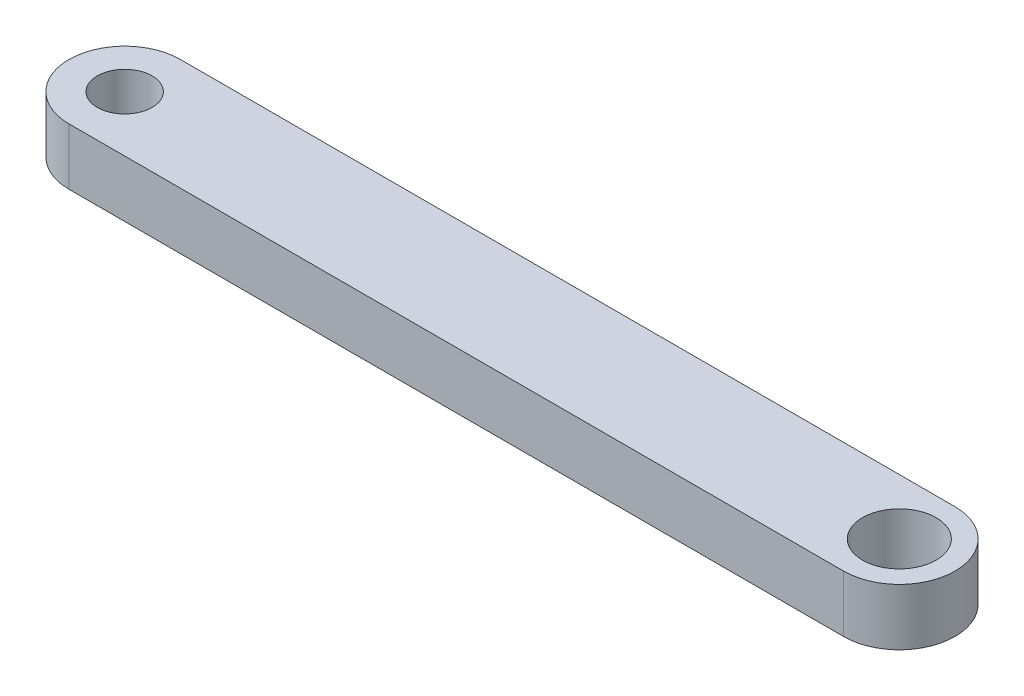
ISO-10303-21;
HEADER;
FILE_DESCRIPTION(('STEP AP214'),'2;1');
FILE_NAME('part.step','',(''),(''),'','','');
FILE_SCHEMA(('AUTOMOTIVE_DESIGN { 1 0 10303 214 1 1 1 1 }'));
ENDSEC;
DATA;
#1=APPLICATION_CONTEXT('core data for automotive mechanical design processes');
#2=APPLICATION_PROTOCOL_DEFINITION('international standard','automotive_design',2000,#1);
#3=PRODUCT_CONTEXT('',#1,'mechanical');
#4=PRODUCT('Part','Part','',(#3));
#5=PRODUCT_RELATED_PRODUCT_CATEGORY('part','',(#4));
#6=PRODUCT_DEFINITION_FORMATION('','',#4);
#7=PRODUCT_DEFINITION_CONTEXT('part definition',#1,'design');
#8=PRODUCT_DEFINITION('design','',#6,#7);
#9=PRODUCT_DEFINITION_SHAPE('','',#8);
#10=(LENGTH_UNIT() NAMED_UNIT(*) SI_UNIT(.MILLI.,.METRE.));
#11=(NAMED_UNIT(*) PLANE_ANGLE_UNIT() SI_UNIT($,.RADIAN.));
#12=(NAMED_UNIT(*) SI_UNIT($,.STERADIAN.) SOLID_ANGLE_UNIT());
#13=UNCERTAINTY_MEASURE_WITH_UNIT(LENGTH_MEASURE(1.E-05),#10,'distance_accuracy_value','');
#14=(GEOMETRIC_REPRESENTATION_CONTEXT(3) GLOBAL_UNCERTAINTY_ASSIGNED_CONTEXT((#13)) GLOBAL_UNIT_ASSIGNED_CONTEXT((#10,
#11,#12)) REPRESENTATION_CONTEXT('',''));
#15=CARTESIAN_POINT('',(0.,0.,0.));
#16=DIRECTION('',(0.,0.,1.));
#17=DIRECTION('',(1.,0.,0.));
#18=AXIS2_PLACEMENT_3D('',#15,#16,#17);
#19=CARTESIAN_POINT('',(32.,3.,0.));
#20=DIRECTION('',(0.,-1.,0.));
#21=DIRECTION('',(0.,0.,-1.));
#22=AXIS2_PLACEMENT_3D('',#19,#20,#21);
#23=CYLINDRICAL_SURFACE('',#22,2.95);
#24=CARTESIAN_POINT('',(32.,0.,0.));
#25=DIRECTION('',(0.,-1.,0.));
#26=DIRECTION('',(0.,0.,-1.));
#27=AXIS2_PLACEMENT_3D('',#24,#25,#26);
#28=CIRCLE('',#27,2.95);
#29=CARTESIAN_POINT('',(32.,0.,-2.95));
#30=VERTEX_POINT('',#29);
#31=CARTESIAN_POINT('',(32.,0.,2.95));
#32=VERTEX_POINT('',#31);
#33=EDGE_CURVE('E98',#30,#32,#28,.T.);
#34=ORIENTED_EDGE('',*,*,#33,.F.);
#35=DIRECTION('',(0.,-1.,0.));
#36=VECTOR('',#35,1.);
#37=CARTESIAN_POINT('',(32.,3.,-2.95));
#38=LINE('',#37,#36);
#39=CARTESIAN_POINT('',(32.,3.,-2.95));
#40=VERTEX_POINT('',#39);
#41=EDGE_CURVE('E11',#40,#30,#38,.T.);
#42=ORIENTED_EDGE('',*,*,#41,.F.);
#43=CARTESIAN_POINT('',(32.,3.,0.));
#44=DIRECTION('',(0.,-1.,0.));
#45=DIRECTION('',(0.,0.,-1.));
#46=AXIS2_PLACEMENT_3D('',#43,#44,#45);
#47=CIRCLE('',#46,2.95);
#48=CARTESIAN_POINT('',(32.,3.,2.95));
#49=VERTEX_POINT('',#48);
#50=EDGE_CURVE('E91',#40,#49,#47,.T.);
#51=ORIENTED_EDGE('',*,*,#50,.T.);
#52=DIRECTION('',(0.,-1.,0.));
#53=VECTOR('',#52,1.);
#54=CARTESIAN_POINT('',(32.,3.,2.95));
#55=LINE('',#54,#53);
#56=EDGE_CURVE('E36',#49,#32,#55,.T.);
#57=ORIENTED_EDGE('',*,*,#56,.T.);
#58=EDGE_LOOP('',(#34,#42,#51,#57));
#59=FACE_BOUND('',#58,.T.);
#60=ADVANCED_FACE('F33',(#59),#23,.T.);
#61=CARTESIAN_POINT('',(-9.,3.,-2.95));
#62=DIRECTION('',(0.,0.,-1.));
#63=DIRECTION('',(-1.,0.,0.));
#64=AXIS2_PLACEMENT_3D('',#61,#62,#63);
#65=PLANE('',#64);
#66=DIRECTION('',(1.,0.,0.));
#67=VECTOR('',#66,1.);
#68=CARTESIAN_POINT('',(-9.,0.,-2.95));
#69=LINE('',#68,#67);
#70=CARTESIAN_POINT('',(-9.,0.,-2.95));
#71=VERTEX_POINT('',#70);
#72=EDGE_CURVE('E93',#71,#30,#69,.T.);
#73=ORIENTED_EDGE('',*,*,#72,.F.);
#74=DIRECTION('',(0.,-1.,0.));
#75=VECTOR('',#74,1.);
#76=CARTESIAN_POINT('',(-9.,3.,-2.95));
#77=LINE('',#76,#75);
#78=CARTESIAN_POINT('',(-9.,3.,-2.95));
#79=VERTEX_POINT('',#78);
#80=EDGE_CURVE('E42',#79,#71,#77,.T.);
#81=ORIENTED_EDGE('',*,*,#80,.F.);
#82=DIRECTION('',(1.,0.,0.));
#83=VECTOR('',#82,1.);
#84=CARTESIAN_POINT('',(-9.,3.,-2.95));
#85=LINE('',#84,#83);
#86=EDGE_CURVE('E88',#79,#40,#85,.T.);
#87=ORIENTED_EDGE('',*,*,#86,.T.);
#88=ORIENTED_EDGE('',*,*,#41,.T.);
#89=EDGE_LOOP('',(#73,#81,#87,#88));
#90=FACE_BOUND('',#89,.T.);
#91=ADVANCED_FACE('F109',(#90),#65,.T.);
#92=CARTESIAN_POINT('',(-9.,3.,0.));
#93=DIRECTION('',(0.,-1.,0.));
#94=DIRECTION('',(0.,0.,-1.));
#95=AXIS2_PLACEMENT_3D('',#92,#93,#94);
#96=CYLINDRICAL_SURFACE('',#95,2.95);
#97=CARTESIAN_POINT('',(-9.,0.,0.));
#98=DIRECTION('',(0.,-1.,0.));
#99=DIRECTION('',(0.,0.,-1.));
#100=AXIS2_PLACEMENT_3D('',#97,#98,#99);
#101=CIRCLE('',#100,2.95);
#102=CARTESIAN_POINT('',(-9.,0.,2.95));
#103=VERTEX_POINT('',#102);
#104=EDGE_CURVE('E83',#103,#71,#101,.T.);
#105=ORIENTED_EDGE('',*,*,#104,.F.);
#106=DIRECTION('',(0.,-1.,0.));
#107=VECTOR('',#106,1.);
#108=CARTESIAN_POINT('',(-9.,3.,2.95));
#109=LINE('',#108,#107);
#110=CARTESIAN_POINT('',(-9.,3.,2.95));
#111=VERTEX_POINT('',#110);
#112=EDGE_CURVE('E78',#111,#103,#109,.T.);
#113=ORIENTED_EDGE('',*,*,#112,.F.);
#114=CARTESIAN_POINT('',(-9.,3.,0.));
#115=DIRECTION('',(0.,-1.,0.));
#116=DIRECTION('',(0.,0.,-1.));
#117=AXIS2_PLACEMENT_3D('',#114,#115,#116);
#118=CIRCLE('',#117,2.95);
#119=EDGE_CURVE('E81',#111,#79,#118,.T.);
#120=ORIENTED_EDGE('',*,*,#119,.T.);
#121=ORIENTED_EDGE('',*,*,#80,.T.);
#122=EDGE_LOOP('',(#105,#113,#120,#121));
#123=FACE_BOUND('',#122,.T.);
#124=ADVANCED_FACE('F80',(#123),#96,.T.);
#125=CARTESIAN_POINT('',(32.,3.,2.95));
#126=DIRECTION('',(0.,0.,1.));
#127=DIRECTION('',(1.,0.,0.));
#128=AXIS2_PLACEMENT_3D('',#125,#126,#127);
#129=PLANE('',#128);
#130=DIRECTION('',(-1.,0.,0.));
#131=VECTOR('',#130,1.);
#132=CARTESIAN_POINT('',(32.,0.,2.95));
#133=LINE('',#132,#131);
#134=EDGE_CURVE('E101',#32,#103,#133,.T.);
#135=ORIENTED_EDGE('',*,*,#134,.F.);
#136=ORIENTED_EDGE('',*,*,#56,.F.);
#137=DIRECTION('',(-1.,0.,0.));
#138=VECTOR('',#137,1.);
#139=CARTESIAN_POINT('',(32.,3.,2.95));
#140=LINE('',#139,#138);
#141=EDGE_CURVE('E87',#49,#111,#140,.T.);
#142=ORIENTED_EDGE('',*,*,#141,.T.);
#143=ORIENTED_EDGE('',*,*,#112,.T.);
#144=EDGE_LOOP('',(#135,#136,#142,#143));
#145=FACE_BOUND('',#144,.T.);
#146=ADVANCED_FACE('F90',(#145),#129,.T.);
#147=CARTESIAN_POINT('',(32.,3.,0.));
#148=DIRECTION('',(0.,-1.,0.));
#149=DIRECTION('',(0.,0.,-1.));
#150=AXIS2_PLACEMENT_3D('',#147,#148,#149);
#151=PLANE('',#150);
#152=CARTESIAN_POINT('',(-9.,3.,0.));
#153=DIRECTION('',(0.,-1.,0.));
#154=DIRECTION('',(0.,0.,1.));
#155=AXIS2_PLACEMENT_3D('',#152,#153,#154);
#156=CIRCLE('',#155,1.45);
#157=CARTESIAN_POINT('',(-9.,3.,1.45));
#158=VERTEX_POINT('',#157);
#159=EDGE_CURVE('E142',#158,#158,#156,.T.);
#160=ORIENTED_EDGE('',*,*,#159,.T.);
#161=EDGE_LOOP('',(#160));
#162=FACE_BOUND('',#161,.T.);
#163=CARTESIAN_POINT('',(32.,3.,0.));
#164=DIRECTION('',(0.,-1.,0.));
#165=DIRECTION('',(0.,0.,1.));
#166=AXIS2_PLACEMENT_3D('',#163,#164,#165);
#167=CIRCLE('',#166,1.95);
#168=CARTESIAN_POINT('',(32.,3.,1.95));
#169=VERTEX_POINT('',#168);
#170=EDGE_CURVE('E102',#169,#169,#167,.T.);
#171=ORIENTED_EDGE('',*,*,#170,.T.);
#172=EDGE_LOOP('',(#171));
#173=FACE_BOUND('',#172,.T.);
#174=ORIENTED_EDGE('',*,*,#50,.F.);
#175=ORIENTED_EDGE('',*,*,#86,.F.);
#176=ORIENTED_EDGE('',*,*,#119,.F.);
#177=ORIENTED_EDGE('',*,*,#141,.F.);
#178=EDGE_LOOP('',(#174,#175,#176,#177));
#179=FACE_BOUND('',#178,.T.);
#180=ADVANCED_FACE('F86',(#162,#173,#179),#151,.F.);
#181=CARTESIAN_POINT('',(32.,0.,0.));
#182=DIRECTION('',(0.,-1.,0.));
#183=DIRECTION('',(0.,0.,-1.));
#184=AXIS2_PLACEMENT_3D('',#181,#182,#183);
#185=PLANE('',#184);
#186=CARTESIAN_POINT('',(-9.,0.,0.));
#187=DIRECTION('',(0.,-1.,0.));
#188=DIRECTION('',(0.,0.,1.));
#189=AXIS2_PLACEMENT_3D('',#186,#187,#188);
#190=CIRCLE('',#189,1.45);
#191=CARTESIAN_POINT('',(-9.,0.,1.45));
#192=VERTEX_POINT('',#191);
#193=EDGE_CURVE('E145',#192,#192,#190,.T.);
#194=ORIENTED_EDGE('',*,*,#193,.F.);
#195=EDGE_LOOP('',(#194));
#196=FACE_BOUND('',#195,.T.);
#197=CARTESIAN_POINT('',(32.,0.,0.));
#198=DIRECTION('',(0.,-1.,0.));
#199=DIRECTION('',(0.,0.,1.));
#200=AXIS2_PLACEMENT_3D('',#197,#198,#199);
#201=CIRCLE('',#200,1.95);
#202=CARTESIAN_POINT('',(32.,0.,1.95));
#203=VERTEX_POINT('',#202);
#204=EDGE_CURVE('E147',#203,#203,#201,.T.);
#205=ORIENTED_EDGE('',*,*,#204,.F.);
#206=EDGE_LOOP('',(#205));
#207=FACE_BOUND('',#206,.T.);
#208=ORIENTED_EDGE('',*,*,#33,.T.);
#209=ORIENTED_EDGE('',*,*,#134,.T.);
#210=ORIENTED_EDGE('',*,*,#104,.T.);
#211=ORIENTED_EDGE('',*,*,#72,.T.);
#212=EDGE_LOOP('',(#208,#209,#210,#211));
#213=FACE_BOUND('',#212,.T.);
#214=ADVANCED_FACE('F108',(#196,#207,#213),#185,.T.);
#215=CARTESIAN_POINT('',(32.,3.,0.));
#216=DIRECTION('',(0.,-1.,0.));
#217=DIRECTION('',(0.,0.,-1.));
#218=AXIS2_PLACEMENT_3D('',#215,#216,#217);
#219=CYLINDRICAL_SURFACE('',#218,1.95);
#220=ORIENTED_EDGE('',*,*,#170,.F.);
#221=EDGE_LOOP('',(#220));
#222=FACE_BOUND('',#221,.T.);
#223=ORIENTED_EDGE('',*,*,#204,.T.);
#224=EDGE_LOOP('',(#223));
#225=FACE_BOUND('',#224,.T.);
#226=ADVANCED_FACE('F127',(#222,#225),#219,.F.);
#227=CARTESIAN_POINT('',(-9.,3.,0.));
#228=DIRECTION('',(0.,-1.,0.));
#229=DIRECTION('',(0.,0.,-1.));
#230=AXIS2_PLACEMENT_3D('',#227,#228,#229);
#231=CYLINDRICAL_SURFACE('',#230,1.45);
#232=ORIENTED_EDGE('',*,*,#159,.F.);
#233=EDGE_LOOP('',(#232));
#234=FACE_BOUND('',#233,.T.);
#235=ORIENTED_EDGE('',*,*,#193,.T.);
#236=EDGE_LOOP('',(#235));
#237=FACE_BOUND('',#236,.T.);
#238=ADVANCED_FACE('F134',(#234,#237),#231,.F.);
#239=CLOSED_SHELL('',(#60,#91,#124,#146,#180,#214,#226,#238));
#240=MANIFOLD_SOLID_BREP('B2',#239);
#241=ADVANCED_BREP_SHAPE_REPRESENTATION('',(#18,#240),#14);
#242=SHAPE_DEFINITION_REPRESENTATION(#9,#241);
ENDSEC;
END-ISO-10303-21;
